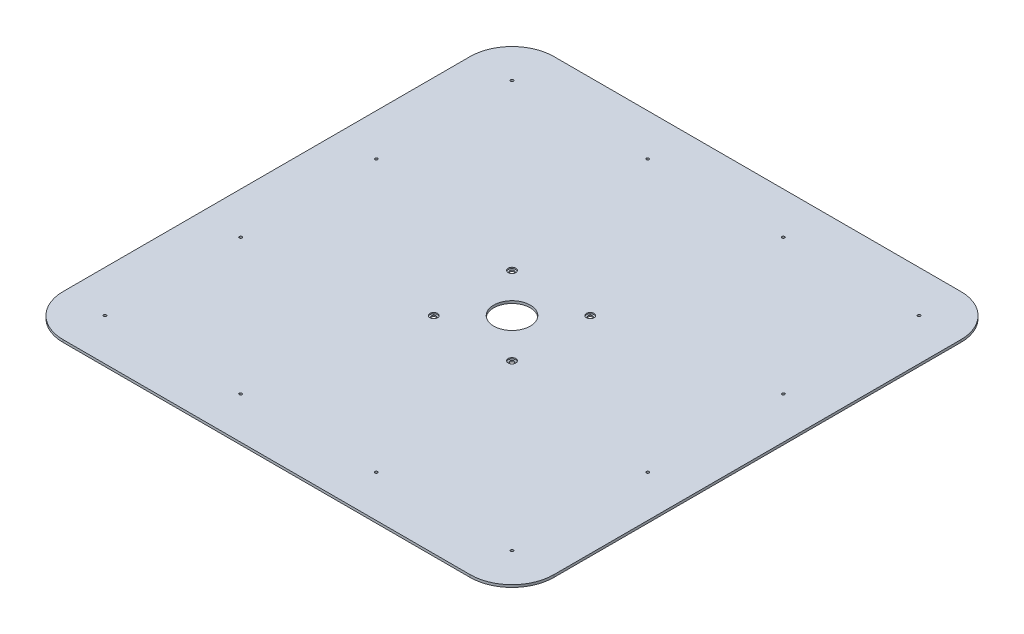
ISO-10303-21;
HEADER;
FILE_DESCRIPTION(('STEP AP214'),'2;1');
FILE_NAME('part.step','',(''),(''),'','','');
FILE_SCHEMA(('AUTOMOTIVE_DESIGN { 1 0 10303 214 1 1 1 1 }'));
ENDSEC;
DATA;
#1=APPLICATION_CONTEXT('core data for automotive mechanical design processes');
#2=APPLICATION_PROTOCOL_DEFINITION('international standard','automotive_design',2000,#1);
#3=PRODUCT_CONTEXT('',#1,'mechanical');
#4=PRODUCT('Part','Part','',(#3));
#5=PRODUCT_RELATED_PRODUCT_CATEGORY('part','',(#4));
#6=PRODUCT_DEFINITION_FORMATION('','',#4);
#7=PRODUCT_DEFINITION_CONTEXT('part definition',#1,'design');
#8=PRODUCT_DEFINITION('design','',#6,#7);
#9=PRODUCT_DEFINITION_SHAPE('','',#8);
#10=(LENGTH_UNIT() NAMED_UNIT(*) SI_UNIT(.MILLI.,.METRE.));
#11=(NAMED_UNIT(*) PLANE_ANGLE_UNIT() SI_UNIT($,.RADIAN.));
#12=(NAMED_UNIT(*) SI_UNIT($,.STERADIAN.) SOLID_ANGLE_UNIT());
#13=UNCERTAINTY_MEASURE_WITH_UNIT(LENGTH_MEASURE(1.E-05),#10,'distance_accuracy_value','');
#14=(GEOMETRIC_REPRESENTATION_CONTEXT(3) GLOBAL_UNCERTAINTY_ASSIGNED_CONTEXT((#13)) GLOBAL_UNIT_ASSIGNED_CONTEXT((#10,
#11,#12)) REPRESENTATION_CONTEXT('',''));
#15=CARTESIAN_POINT('',(0.,0.,0.));
#16=DIRECTION('',(0.,0.,1.));
#17=DIRECTION('',(1.,0.,0.));
#18=AXIS2_PLACEMENT_3D('',#15,#16,#17);
#19=CARTESIAN_POINT('',(-47.625,1.5,47.625));
#20=DIRECTION('',(0.,1.,0.));
#21=DIRECTION('',(0.,0.,1.));
#22=AXIS2_PLACEMENT_3D('',#19,#20,#21);
#23=CYLINDRICAL_SURFACE('',#22,4.699);
#24=CARTESIAN_POINT('',(-47.625,3.,47.625));
#25=DIRECTION('',(0.,1.,0.));
#26=DIRECTION('',(0.,0.,1.));
#27=AXIS2_PLACEMENT_3D('',#24,#25,#26);
#28=CIRCLE('',#27,4.699);
#29=CARTESIAN_POINT('',(-47.625,3.,52.324));
#30=VERTEX_POINT('',#29);
#31=EDGE_CURVE('E244',#30,#30,#28,.F.);
#32=ORIENTED_EDGE('',*,*,#31,.F.);
#33=EDGE_LOOP('',(#32));
#34=FACE_BOUND('',#33,.T.);
#35=CARTESIAN_POINT('',(-47.625,1.5,47.625));
#36=DIRECTION('',(0.,1.,0.));
#37=DIRECTION('',(0.,0.,1.));
#38=AXIS2_PLACEMENT_3D('',#35,#36,#37);
#39=CIRCLE('',#38,4.699);
#40=CARTESIAN_POINT('',(-47.625,1.5,52.324));
#41=VERTEX_POINT('',#40);
#42=EDGE_CURVE('E19',#41,#41,#39,.T.);
#43=ORIENTED_EDGE('',*,*,#42,.F.);
#44=EDGE_LOOP('',(#43));
#45=FACE_BOUND('',#44,.T.);
#46=ADVANCED_FACE('F16',(#34,#45),#23,.F.);
#47=CARTESIAN_POINT('',(47.625,1.5,47.625));
#48=DIRECTION('',(0.,1.,0.));
#49=DIRECTION('',(0.,0.,1.));
#50=AXIS2_PLACEMENT_3D('',#47,#48,#49);
#51=CYLINDRICAL_SURFACE('',#50,4.699);
#52=CARTESIAN_POINT('',(47.625,3.,47.625));
#53=DIRECTION('',(0.,1.,0.));
#54=DIRECTION('',(0.,0.,1.));
#55=AXIS2_PLACEMENT_3D('',#52,#53,#54);
#56=CIRCLE('',#55,4.699);
#57=CARTESIAN_POINT('',(47.625,3.,52.324));
#58=VERTEX_POINT('',#57);
#59=EDGE_CURVE('E241',#58,#58,#56,.F.);
#60=ORIENTED_EDGE('',*,*,#59,.F.);
#61=EDGE_LOOP('',(#60));
#62=FACE_BOUND('',#61,.T.);
#63=CARTESIAN_POINT('',(47.625,1.5,47.625));
#64=DIRECTION('',(0.,1.,0.));
#65=DIRECTION('',(0.,0.,1.));
#66=AXIS2_PLACEMENT_3D('',#63,#64,#65);
#67=CIRCLE('',#66,4.699);
#68=CARTESIAN_POINT('',(47.625,1.5,52.324));
#69=VERTEX_POINT('',#68);
#70=EDGE_CURVE('E252',#69,#69,#67,.T.);
#71=ORIENTED_EDGE('',*,*,#70,.F.);
#72=EDGE_LOOP('',(#71));
#73=FACE_BOUND('',#72,.T.);
#74=ADVANCED_FACE('F262',(#62,#73),#51,.F.);
#75=CARTESIAN_POINT('',(47.625,1.5,-47.625));
#76=DIRECTION('',(0.,1.,0.));
#77=DIRECTION('',(0.,0.,1.));
#78=AXIS2_PLACEMENT_3D('',#75,#76,#77);
#79=CYLINDRICAL_SURFACE('',#78,4.699);
#80=CARTESIAN_POINT('',(47.625,3.,-47.625));
#81=DIRECTION('',(0.,1.,0.));
#82=DIRECTION('',(0.,0.,1.));
#83=AXIS2_PLACEMENT_3D('',#80,#81,#82);
#84=CIRCLE('',#83,4.699);
#85=CARTESIAN_POINT('',(47.625,3.,-42.926));
#86=VERTEX_POINT('',#85);
#87=EDGE_CURVE('E238',#86,#86,#84,.F.);
#88=ORIENTED_EDGE('',*,*,#87,.F.);
#89=EDGE_LOOP('',(#88));
#90=FACE_BOUND('',#89,.T.);
#91=CARTESIAN_POINT('',(47.625,1.5,-47.625));
#92=DIRECTION('',(0.,1.,0.));
#93=DIRECTION('',(0.,0.,1.));
#94=AXIS2_PLACEMENT_3D('',#91,#92,#93);
#95=CIRCLE('',#94,4.699);
#96=CARTESIAN_POINT('',(47.625,1.5,-42.926));
#97=VERTEX_POINT('',#96);
#98=EDGE_CURVE('E250',#97,#97,#95,.T.);
#99=ORIENTED_EDGE('',*,*,#98,.F.);
#100=EDGE_LOOP('',(#99));
#101=FACE_BOUND('',#100,.T.);
#102=ADVANCED_FACE('F268',(#90,#101),#79,.F.);
#103=CARTESIAN_POINT('',(-47.625,1.5,-47.625));
#104=DIRECTION('',(0.,1.,0.));
#105=DIRECTION('',(0.,0.,1.));
#106=AXIS2_PLACEMENT_3D('',#103,#104,#105);
#107=CYLINDRICAL_SURFACE('',#106,4.699);
#108=CARTESIAN_POINT('',(-47.625,3.,-47.625));
#109=DIRECTION('',(0.,1.,0.));
#110=DIRECTION('',(0.,0.,1.));
#111=AXIS2_PLACEMENT_3D('',#108,#109,#110);
#112=CIRCLE('',#111,4.699);
#113=CARTESIAN_POINT('',(-47.625,3.,-42.926));
#114=VERTEX_POINT('',#113);
#115=EDGE_CURVE('E235',#114,#114,#112,.F.);
#116=ORIENTED_EDGE('',*,*,#115,.F.);
#117=EDGE_LOOP('',(#116));
#118=FACE_BOUND('',#117,.T.);
#119=CARTESIAN_POINT('',(-47.625,1.5,-47.625));
#120=DIRECTION('',(0.,1.,0.));
#121=DIRECTION('',(0.,0.,1.));
#122=AXIS2_PLACEMENT_3D('',#119,#120,#121);
#123=CIRCLE('',#122,4.699);
#124=CARTESIAN_POINT('',(-47.625,1.5,-42.926));
#125=VERTEX_POINT('',#124);
#126=EDGE_CURVE('E247',#125,#125,#123,.T.);
#127=ORIENTED_EDGE('',*,*,#126,.F.);
#128=EDGE_LOOP('',(#127));
#129=FACE_BOUND('',#128,.T.);
#130=ADVANCED_FACE('F393',(#118,#129),#107,.F.);
#131=CARTESIAN_POINT('',(-47.625,1.5,47.625));
#132=DIRECTION('',(0.,1.,0.));
#133=DIRECTION('',(0.,0.,1.));
#134=AXIS2_PLACEMENT_3D('',#131,#132,#133);
#135=PLANE('',#134);
#136=CARTESIAN_POINT('',(-47.625,1.5,47.625));
#137=DIRECTION('',(0.,1.,0.));
#138=DIRECTION('',(0.,0.,1.));
#139=AXIS2_PLACEMENT_3D('',#136,#137,#138);
#140=CIRCLE('',#139,2.667);
#141=CARTESIAN_POINT('',(-47.625,1.5,50.292));
#142=VERTEX_POINT('',#141);
#143=EDGE_CURVE('E232',#142,#142,#140,.F.);
#144=ORIENTED_EDGE('',*,*,#143,.T.);
#145=EDGE_LOOP('',(#144));
#146=FACE_BOUND('',#145,.T.);
#147=ORIENTED_EDGE('',*,*,#42,.T.);
#148=EDGE_LOOP('',(#147));
#149=FACE_BOUND('',#148,.T.);
#150=ADVANCED_FACE('F259',(#146,#149),#135,.T.);
#151=CARTESIAN_POINT('',(47.625,1.5,47.625));
#152=DIRECTION('',(0.,1.,0.));
#153=DIRECTION('',(0.,0.,1.));
#154=AXIS2_PLACEMENT_3D('',#151,#152,#153);
#155=PLANE('',#154);
#156=CARTESIAN_POINT('',(47.625,1.5,47.625));
#157=DIRECTION('',(0.,1.,0.));
#158=DIRECTION('',(0.,0.,1.));
#159=AXIS2_PLACEMENT_3D('',#156,#157,#158);
#160=CIRCLE('',#159,2.667);
#161=CARTESIAN_POINT('',(47.625,1.5,50.292));
#162=VERTEX_POINT('',#161);
#163=EDGE_CURVE('E229',#162,#162,#160,.F.);
#164=ORIENTED_EDGE('',*,*,#163,.T.);
#165=EDGE_LOOP('',(#164));
#166=FACE_BOUND('',#165,.T.);
#167=ORIENTED_EDGE('',*,*,#70,.T.);
#168=EDGE_LOOP('',(#167));
#169=FACE_BOUND('',#168,.T.);
#170=ADVANCED_FACE('F386',(#166,#169),#155,.T.);
#171=CARTESIAN_POINT('',(47.625,1.5,-47.625));
#172=DIRECTION('',(0.,1.,0.));
#173=DIRECTION('',(0.,0.,1.));
#174=AXIS2_PLACEMENT_3D('',#171,#172,#173);
#175=PLANE('',#174);
#176=CARTESIAN_POINT('',(47.625,1.5,-47.625));
#177=DIRECTION('',(0.,1.,0.));
#178=DIRECTION('',(0.,0.,1.));
#179=AXIS2_PLACEMENT_3D('',#176,#177,#178);
#180=CIRCLE('',#179,2.667);
#181=CARTESIAN_POINT('',(47.625,1.5,-44.958));
#182=VERTEX_POINT('',#181);
#183=EDGE_CURVE('E226',#182,#182,#180,.F.);
#184=ORIENTED_EDGE('',*,*,#183,.T.);
#185=EDGE_LOOP('',(#184));
#186=FACE_BOUND('',#185,.T.);
#187=ORIENTED_EDGE('',*,*,#98,.T.);
#188=EDGE_LOOP('',(#187));
#189=FACE_BOUND('',#188,.T.);
#190=ADVANCED_FACE('F382',(#186,#189),#175,.T.);
#191=CARTESIAN_POINT('',(-47.625,1.5,-47.625));
#192=DIRECTION('',(0.,1.,0.));
#193=DIRECTION('',(0.,0.,1.));
#194=AXIS2_PLACEMENT_3D('',#191,#192,#193);
#195=PLANE('',#194);
#196=CARTESIAN_POINT('',(-47.625,1.5,-47.625));
#197=DIRECTION('',(0.,1.,0.));
#198=DIRECTION('',(0.,0.,1.));
#199=AXIS2_PLACEMENT_3D('',#196,#197,#198);
#200=CIRCLE('',#199,2.667);
#201=CARTESIAN_POINT('',(-47.625,1.5,-44.958));
#202=VERTEX_POINT('',#201);
#203=EDGE_CURVE('E223',#202,#202,#200,.F.);
#204=ORIENTED_EDGE('',*,*,#203,.T.);
#205=EDGE_LOOP('',(#204));
#206=FACE_BOUND('',#205,.T.);
#207=ORIENTED_EDGE('',*,*,#126,.T.);
#208=EDGE_LOOP('',(#207));
#209=FACE_BOUND('',#208,.T.);
#210=ADVANCED_FACE('F378',(#206,#209),#195,.T.);
#211=CARTESIAN_POINT('',(0.,3.,0.));
#212=DIRECTION('',(0.,1.,0.));
#213=DIRECTION('',(0.,0.,1.));
#214=AXIS2_PLACEMENT_3D('',#211,#212,#213);
#215=PLANE('',#214);
#216=CARTESIAN_POINT('',(0.,3.,1.11022302462516E-13));
#217=DIRECTION('',(0.,-1.,0.));
#218=DIRECTION('',(0.,0.,-1.));
#219=AXIS2_PLACEMENT_3D('',#216,#217,#218);
#220=CIRCLE('',#219,22.225);
#221=CARTESIAN_POINT('',(0.,3.,-22.2249999999999));
#222=VERTEX_POINT('',#221);
#223=EDGE_CURVE('E110',#222,#222,#220,.T.);
#224=ORIENTED_EDGE('',*,*,#223,.T.);
#225=EDGE_LOOP('',(#224));
#226=FACE_BOUND('',#225,.T.);
#227=DIRECTION('',(0.,0.,1.));
#228=VECTOR('',#227,1.);
#229=CARTESIAN_POINT('',(298.45,3.,298.45));
#230=LINE('',#229,#228);
#231=CARTESIAN_POINT('',(298.45,3.,247.65));
#232=VERTEX_POINT('',#231);
#233=CARTESIAN_POINT('',(298.45,3.,-247.65));
#234=VERTEX_POINT('',#233);
#235=EDGE_CURVE('E116',#232,#234,#230,.F.);
#236=ORIENTED_EDGE('',*,*,#235,.T.);
#237=CARTESIAN_POINT('',(247.65,3.,-247.65));
#238=DIRECTION('',(0.,-1.,0.));
#239=DIRECTION('',(0.,0.,-1.));
#240=AXIS2_PLACEMENT_3D('',#237,#238,#239);
#241=CIRCLE('',#240,50.8);
#242=CARTESIAN_POINT('',(247.65,3.,-298.45));
#243=VERTEX_POINT('',#242);
#244=EDGE_CURVE('E117',#243,#234,#241,.T.);
#245=ORIENTED_EDGE('',*,*,#244,.F.);
#246=DIRECTION('',(1.,0.,0.));
#247=VECTOR('',#246,1.);
#248=CARTESIAN_POINT('',(298.45,3.,-298.45));
#249=LINE('',#248,#247);
#250=CARTESIAN_POINT('',(-247.65,3.,-298.45));
#251=VERTEX_POINT('',#250);
#252=EDGE_CURVE('E111',#243,#251,#249,.F.);
#253=ORIENTED_EDGE('',*,*,#252,.T.);
#254=CARTESIAN_POINT('',(-247.65,3.,-247.65));
#255=DIRECTION('',(0.,-1.,0.));
#256=DIRECTION('',(0.,0.,-1.));
#257=AXIS2_PLACEMENT_3D('',#254,#255,#256);
#258=CIRCLE('',#257,50.8);
#259=CARTESIAN_POINT('',(-298.45,3.,-247.65));
#260=VERTEX_POINT('',#259);
#261=EDGE_CURVE('E114',#260,#251,#258,.T.);
#262=ORIENTED_EDGE('',*,*,#261,.F.);
#263=DIRECTION('',(0.,0.,-1.));
#264=VECTOR('',#263,1.);
#265=CARTESIAN_POINT('',(-298.45,3.,298.45));
#266=LINE('',#265,#264);
#267=CARTESIAN_POINT('',(-298.45,3.,247.65));
#268=VERTEX_POINT('',#267);
#269=EDGE_CURVE('E87',#260,#268,#266,.F.);
#270=ORIENTED_EDGE('',*,*,#269,.T.);
#271=CARTESIAN_POINT('',(-247.65,3.,247.65));
#272=DIRECTION('',(0.,-1.,0.));
#273=DIRECTION('',(0.,0.,-1.));
#274=AXIS2_PLACEMENT_3D('',#271,#272,#273);
#275=CIRCLE('',#274,50.8);
#276=CARTESIAN_POINT('',(-247.65,3.,298.45));
#277=VERTEX_POINT('',#276);
#278=EDGE_CURVE('E80',#277,#268,#275,.T.);
#279=ORIENTED_EDGE('',*,*,#278,.F.);
#280=DIRECTION('',(-1.,0.,0.));
#281=VECTOR('',#280,1.);
#282=CARTESIAN_POINT('',(298.45,3.,298.45));
#283=LINE('',#282,#281);
#284=CARTESIAN_POINT('',(247.65,3.,298.45));
#285=VERTEX_POINT('',#284);
#286=EDGE_CURVE('E85',#277,#285,#283,.F.);
#287=ORIENTED_EDGE('',*,*,#286,.T.);
#288=CARTESIAN_POINT('',(247.65,3.,247.65));
#289=DIRECTION('',(0.,-1.,0.));
#290=DIRECTION('',(0.,0.,-1.));
#291=AXIS2_PLACEMENT_3D('',#288,#289,#290);
#292=CIRCLE('',#291,50.8);
#293=EDGE_CURVE('E100',#232,#285,#292,.T.);
#294=ORIENTED_EDGE('',*,*,#293,.F.);
#295=EDGE_LOOP('',(#236,#245,#253,#262,#270,#279,#287,#294));
#296=FACE_BOUND('',#295,.T.);
#297=CARTESIAN_POINT('',(-247.65,3.,-247.65));
#298=DIRECTION('',(0.,1.,0.));
#299=DIRECTION('',(0.,0.,1.));
#300=AXIS2_PLACEMENT_3D('',#297,#298,#299);
#301=CIRCLE('',#300,1.65100000000001);
#302=CARTESIAN_POINT('',(-247.65,3.,-245.999));
#303=VERTEX_POINT('',#302);
#304=EDGE_CURVE('E93',#303,#303,#301,.F.);
#305=ORIENTED_EDGE('',*,*,#304,.T.);
#306=EDGE_LOOP('',(#305));
#307=FACE_BOUND('',#306,.T.);
#308=CARTESIAN_POINT('',(247.65,3.,-247.65));
#309=DIRECTION('',(0.,1.,0.));
#310=DIRECTION('',(0.,0.,1.));
#311=AXIS2_PLACEMENT_3D('',#308,#309,#310);
#312=CIRCLE('',#311,1.65100000000001);
#313=CARTESIAN_POINT('',(247.65,3.,-245.999));
#314=VERTEX_POINT('',#313);
#315=EDGE_CURVE('E190',#314,#314,#312,.F.);
#316=ORIENTED_EDGE('',*,*,#315,.T.);
#317=EDGE_LOOP('',(#316));
#318=FACE_BOUND('',#317,.T.);
#319=CARTESIAN_POINT('',(247.65,3.,247.65));
#320=DIRECTION('',(0.,1.,0.));
#321=DIRECTION('',(0.,0.,1.));
#322=AXIS2_PLACEMENT_3D('',#319,#320,#321);
#323=CIRCLE('',#322,1.65100000000001);
#324=CARTESIAN_POINT('',(247.65,3.,249.301));
#325=VERTEX_POINT('',#324);
#326=EDGE_CURVE('E193',#325,#325,#323,.F.);
#327=ORIENTED_EDGE('',*,*,#326,.T.);
#328=EDGE_LOOP('',(#327));
#329=FACE_BOUND('',#328,.T.);
#330=CARTESIAN_POINT('',(-247.65,3.,247.65));
#331=DIRECTION('',(0.,1.,0.));
#332=DIRECTION('',(0.,0.,1.));
#333=AXIS2_PLACEMENT_3D('',#330,#331,#332);
#334=CIRCLE('',#333,1.65100000000001);
#335=CARTESIAN_POINT('',(-247.65,3.,249.301));
#336=VERTEX_POINT('',#335);
#337=EDGE_CURVE('E196',#336,#336,#334,.F.);
#338=ORIENTED_EDGE('',*,*,#337,.T.);
#339=EDGE_LOOP('',(#338));
#340=FACE_BOUND('',#339,.T.);
#341=CARTESIAN_POINT('',(82.55,3.,-247.65));
#342=DIRECTION('',(0.,1.,0.));
#343=DIRECTION('',(0.,0.,1.));
#344=AXIS2_PLACEMENT_3D('',#341,#342,#343);
#345=CIRCLE('',#344,1.65100000000001);
#346=CARTESIAN_POINT('',(82.55,3.,-245.999));
#347=VERTEX_POINT('',#346);
#348=EDGE_CURVE('E199',#347,#347,#345,.F.);
#349=ORIENTED_EDGE('',*,*,#348,.T.);
#350=EDGE_LOOP('',(#349));
#351=FACE_BOUND('',#350,.T.);
#352=CARTESIAN_POINT('',(-82.55,3.,-247.65));
#353=DIRECTION('',(0.,1.,0.));
#354=DIRECTION('',(0.,0.,1.));
#355=AXIS2_PLACEMENT_3D('',#352,#353,#354);
#356=CIRCLE('',#355,1.65100000000001);
#357=CARTESIAN_POINT('',(-82.55,3.,-245.999));
#358=VERTEX_POINT('',#357);
#359=EDGE_CURVE('E202',#358,#358,#356,.F.);
#360=ORIENTED_EDGE('',*,*,#359,.T.);
#361=EDGE_LOOP('',(#360));
#362=FACE_BOUND('',#361,.T.);
#363=CARTESIAN_POINT('',(247.65,3.,-82.5499999999999));
#364=DIRECTION('',(0.,1.,0.));
#365=DIRECTION('',(0.,0.,1.));
#366=AXIS2_PLACEMENT_3D('',#363,#364,#365);
#367=CIRCLE('',#366,1.65100000000001);
#368=CARTESIAN_POINT('',(247.65,3.,-80.8989999999999));
#369=VERTEX_POINT('',#368);
#370=EDGE_CURVE('E205',#369,#369,#367,.F.);
#371=ORIENTED_EDGE('',*,*,#370,.T.);
#372=EDGE_LOOP('',(#371));
#373=FACE_BOUND('',#372,.T.);
#374=CARTESIAN_POINT('',(247.65,3.,82.5499999999999));
#375=DIRECTION('',(0.,1.,0.));
#376=DIRECTION('',(0.,0.,1.));
#377=AXIS2_PLACEMENT_3D('',#374,#375,#376);
#378=CIRCLE('',#377,1.65100000000001);
#379=CARTESIAN_POINT('',(247.65,3.,84.2009999999999));
#380=VERTEX_POINT('',#379);
#381=EDGE_CURVE('E208',#380,#380,#378,.F.);
#382=ORIENTED_EDGE('',*,*,#381,.T.);
#383=EDGE_LOOP('',(#382));
#384=FACE_BOUND('',#383,.T.);
#385=CARTESIAN_POINT('',(82.55,3.,247.65));
#386=DIRECTION('',(0.,1.,0.));
#387=DIRECTION('',(0.,0.,1.));
#388=AXIS2_PLACEMENT_3D('',#385,#386,#387);
#389=CIRCLE('',#388,1.65100000000001);
#390=CARTESIAN_POINT('',(82.55,3.,249.301));
#391=VERTEX_POINT('',#390);
#392=EDGE_CURVE('E211',#391,#391,#389,.F.);
#393=ORIENTED_EDGE('',*,*,#392,.T.);
#394=EDGE_LOOP('',(#393));
#395=FACE_BOUND('',#394,.T.);
#396=CARTESIAN_POINT('',(-82.55,3.,247.65));
#397=DIRECTION('',(0.,1.,0.));
#398=DIRECTION('',(0.,0.,1.));
#399=AXIS2_PLACEMENT_3D('',#396,#397,#398);
#400=CIRCLE('',#399,1.65100000000001);
#401=CARTESIAN_POINT('',(-82.55,3.,249.301));
#402=VERTEX_POINT('',#401);
#403=EDGE_CURVE('E214',#402,#402,#400,.F.);
#404=ORIENTED_EDGE('',*,*,#403,.T.);
#405=EDGE_LOOP('',(#404));
#406=FACE_BOUND('',#405,.T.);
#407=CARTESIAN_POINT('',(-247.65,3.,82.5499999999999));
#408=DIRECTION('',(0.,1.,0.));
#409=DIRECTION('',(0.,0.,1.));
#410=AXIS2_PLACEMENT_3D('',#407,#408,#409);
#411=CIRCLE('',#410,1.65100000000001);
#412=CARTESIAN_POINT('',(-247.65,3.,84.2009999999999));
#413=VERTEX_POINT('',#412);
#414=EDGE_CURVE('E217',#413,#413,#411,.F.);
#415=ORIENTED_EDGE('',*,*,#414,.T.);
#416=EDGE_LOOP('',(#415));
#417=FACE_BOUND('',#416,.T.);
#418=CARTESIAN_POINT('',(-247.65,3.,-82.5499999999999));
#419=DIRECTION('',(0.,1.,0.));
#420=DIRECTION('',(0.,0.,1.));
#421=AXIS2_PLACEMENT_3D('',#418,#419,#420);
#422=CIRCLE('',#421,1.65100000000001);
#423=CARTESIAN_POINT('',(-247.65,3.,-80.8989999999999));
#424=VERTEX_POINT('',#423);
#425=EDGE_CURVE('E220',#424,#424,#422,.F.);
#426=ORIENTED_EDGE('',*,*,#425,.T.);
#427=EDGE_LOOP('',(#426));
#428=FACE_BOUND('',#427,.T.);
#429=ORIENTED_EDGE('',*,*,#115,.T.);
#430=EDGE_LOOP('',(#429));
#431=FACE_BOUND('',#430,.T.);
#432=ORIENTED_EDGE('',*,*,#87,.T.);
#433=EDGE_LOOP('',(#432));
#434=FACE_BOUND('',#433,.T.);
#435=ORIENTED_EDGE('',*,*,#59,.T.);
#436=EDGE_LOOP('',(#435));
#437=FACE_BOUND('',#436,.T.);
#438=ORIENTED_EDGE('',*,*,#31,.T.);
#439=EDGE_LOOP('',(#438));
#440=FACE_BOUND('',#439,.T.);
#441=ADVANCED_FACE('F83',(#226,#296,#307,#318,#329,#340,#351,#362,#373,#384,#395,#406,#417,#428,
#431,#434,#437,#440),#215,.T.);
#442=CARTESIAN_POINT('',(-47.625,0.,47.625));
#443=DIRECTION('',(0.,1.,0.));
#444=DIRECTION('',(0.,0.,1.));
#445=AXIS2_PLACEMENT_3D('',#442,#443,#444);
#446=CYLINDRICAL_SURFACE('',#445,2.667);
#447=CARTESIAN_POINT('',(-47.625,0.,47.625));
#448=DIRECTION('',(0.,1.,0.));
#449=DIRECTION('',(0.,0.,1.));
#450=AXIS2_PLACEMENT_3D('',#447,#448,#449);
#451=CIRCLE('',#450,2.667);
#452=CARTESIAN_POINT('',(-47.625,0.,50.292));
#453=VERTEX_POINT('',#452);
#454=EDGE_CURVE('E178',#453,#453,#451,.F.);
#455=ORIENTED_EDGE('',*,*,#454,.T.);
#456=EDGE_LOOP('',(#455));
#457=FACE_BOUND('',#456,.T.);
#458=ORIENTED_EDGE('',*,*,#143,.F.);
#459=EDGE_LOOP('',(#458));
#460=FACE_BOUND('',#459,.T.);
#461=ADVANCED_FACE('F371',(#457,#460),#446,.F.);
#462=CARTESIAN_POINT('',(47.625,0.,47.625));
#463=DIRECTION('',(0.,1.,0.));
#464=DIRECTION('',(0.,0.,1.));
#465=AXIS2_PLACEMENT_3D('',#462,#463,#464);
#466=CYLINDRICAL_SURFACE('',#465,2.667);
#467=CARTESIAN_POINT('',(47.625,0.,47.625));
#468=DIRECTION('',(0.,1.,0.));
#469=DIRECTION('',(0.,0.,1.));
#470=AXIS2_PLACEMENT_3D('',#467,#468,#469);
#471=CIRCLE('',#470,2.667);
#472=CARTESIAN_POINT('',(47.625,0.,50.292));
#473=VERTEX_POINT('',#472);
#474=EDGE_CURVE('E175',#473,#473,#471,.F.);
#475=ORIENTED_EDGE('',*,*,#474,.T.);
#476=EDGE_LOOP('',(#475));
#477=FACE_BOUND('',#476,.T.);
#478=ORIENTED_EDGE('',*,*,#163,.F.);
#479=EDGE_LOOP('',(#478));
#480=FACE_BOUND('',#479,.T.);
#481=ADVANCED_FACE('F367',(#477,#480),#466,.F.);
#482=CARTESIAN_POINT('',(47.625,0.,-47.625));
#483=DIRECTION('',(0.,1.,0.));
#484=DIRECTION('',(0.,0.,1.));
#485=AXIS2_PLACEMENT_3D('',#482,#483,#484);
#486=CYLINDRICAL_SURFACE('',#485,2.667);
#487=CARTESIAN_POINT('',(47.625,0.,-47.625));
#488=DIRECTION('',(0.,1.,0.));
#489=DIRECTION('',(0.,0.,1.));
#490=AXIS2_PLACEMENT_3D('',#487,#488,#489);
#491=CIRCLE('',#490,2.667);
#492=CARTESIAN_POINT('',(47.625,0.,-44.958));
#493=VERTEX_POINT('',#492);
#494=EDGE_CURVE('E172',#493,#493,#491,.F.);
#495=ORIENTED_EDGE('',*,*,#494,.T.);
#496=EDGE_LOOP('',(#495));
#497=FACE_BOUND('',#496,.T.);
#498=ORIENTED_EDGE('',*,*,#183,.F.);
#499=EDGE_LOOP('',(#498));
#500=FACE_BOUND('',#499,.T.);
#501=ADVANCED_FACE('F363',(#497,#500),#486,.F.);
#502=CARTESIAN_POINT('',(-47.625,0.,-47.625));
#503=DIRECTION('',(0.,1.,0.));
#504=DIRECTION('',(0.,0.,1.));
#505=AXIS2_PLACEMENT_3D('',#502,#503,#504);
#506=CYLINDRICAL_SURFACE('',#505,2.667);
#507=CARTESIAN_POINT('',(-47.625,0.,-47.625));
#508=DIRECTION('',(0.,1.,0.));
#509=DIRECTION('',(0.,0.,1.));
#510=AXIS2_PLACEMENT_3D('',#507,#508,#509);
#511=CIRCLE('',#510,2.667);
#512=CARTESIAN_POINT('',(-47.625,0.,-44.958));
#513=VERTEX_POINT('',#512);
#514=EDGE_CURVE('E169',#513,#513,#511,.F.);
#515=ORIENTED_EDGE('',*,*,#514,.T.);
#516=EDGE_LOOP('',(#515));
#517=FACE_BOUND('',#516,.T.);
#518=ORIENTED_EDGE('',*,*,#203,.F.);
#519=EDGE_LOOP('',(#518));
#520=FACE_BOUND('',#519,.T.);
#521=ADVANCED_FACE('F359',(#517,#520),#506,.F.);
#522=CARTESIAN_POINT('',(-247.65,0.,-82.5499999999999));
#523=DIRECTION('',(0.,1.,0.));
#524=DIRECTION('',(0.,0.,1.));
#525=AXIS2_PLACEMENT_3D('',#522,#523,#524);
#526=CYLINDRICAL_SURFACE('',#525,1.65100000000001);
#527=CARTESIAN_POINT('',(-247.65,0.,-82.5499999999999));
#528=DIRECTION('',(0.,1.,0.));
#529=DIRECTION('',(0.,0.,1.));
#530=AXIS2_PLACEMENT_3D('',#527,#528,#529);
#531=CIRCLE('',#530,1.65100000000001);
#532=CARTESIAN_POINT('',(-247.65,0.,-80.8989999999999));
#533=VERTEX_POINT('',#532);
#534=EDGE_CURVE('E166',#533,#533,#531,.F.);
#535=ORIENTED_EDGE('',*,*,#534,.T.);
#536=EDGE_LOOP('',(#535));
#537=FACE_BOUND('',#536,.T.);
#538=ORIENTED_EDGE('',*,*,#425,.F.);
#539=EDGE_LOOP('',(#538));
#540=FACE_BOUND('',#539,.T.);
#541=ADVANCED_FACE('F355',(#537,#540),#526,.F.);
#542=CARTESIAN_POINT('',(-247.65,0.,82.5499999999999));
#543=DIRECTION('',(0.,1.,0.));
#544=DIRECTION('',(0.,0.,1.));
#545=AXIS2_PLACEMENT_3D('',#542,#543,#544);
#546=CYLINDRICAL_SURFACE('',#545,1.65100000000001);
#547=CARTESIAN_POINT('',(-247.65,0.,82.5499999999999));
#548=DIRECTION('',(0.,1.,0.));
#549=DIRECTION('',(0.,0.,1.));
#550=AXIS2_PLACEMENT_3D('',#547,#548,#549);
#551=CIRCLE('',#550,1.65100000000001);
#552=CARTESIAN_POINT('',(-247.65,0.,84.2009999999999));
#553=VERTEX_POINT('',#552);
#554=EDGE_CURVE('E163',#553,#553,#551,.F.);
#555=ORIENTED_EDGE('',*,*,#554,.T.);
#556=EDGE_LOOP('',(#555));
#557=FACE_BOUND('',#556,.T.);
#558=ORIENTED_EDGE('',*,*,#414,.F.);
#559=EDGE_LOOP('',(#558));
#560=FACE_BOUND('',#559,.T.);
#561=ADVANCED_FACE('F351',(#557,#560),#546,.F.);
#562=CARTESIAN_POINT('',(-82.55,0.,247.65));
#563=DIRECTION('',(0.,1.,0.));
#564=DIRECTION('',(0.,0.,1.));
#565=AXIS2_PLACEMENT_3D('',#562,#563,#564);
#566=CYLINDRICAL_SURFACE('',#565,1.65100000000001);
#567=CARTESIAN_POINT('',(-82.55,0.,247.65));
#568=DIRECTION('',(0.,1.,0.));
#569=DIRECTION('',(0.,0.,1.));
#570=AXIS2_PLACEMENT_3D('',#567,#568,#569);
#571=CIRCLE('',#570,1.65100000000001);
#572=CARTESIAN_POINT('',(-82.55,0.,249.301));
#573=VERTEX_POINT('',#572);
#574=EDGE_CURVE('E160',#573,#573,#571,.F.);
#575=ORIENTED_EDGE('',*,*,#574,.T.);
#576=EDGE_LOOP('',(#575));
#577=FACE_BOUND('',#576,.T.);
#578=ORIENTED_EDGE('',*,*,#403,.F.);
#579=EDGE_LOOP('',(#578));
#580=FACE_BOUND('',#579,.T.);
#581=ADVANCED_FACE('F347',(#577,#580),#566,.F.);
#582=CARTESIAN_POINT('',(82.55,0.,247.65));
#583=DIRECTION('',(0.,1.,0.));
#584=DIRECTION('',(0.,0.,1.));
#585=AXIS2_PLACEMENT_3D('',#582,#583,#584);
#586=CYLINDRICAL_SURFACE('',#585,1.65100000000001);
#587=CARTESIAN_POINT('',(82.55,0.,247.65));
#588=DIRECTION('',(0.,1.,0.));
#589=DIRECTION('',(0.,0.,1.));
#590=AXIS2_PLACEMENT_3D('',#587,#588,#589);
#591=CIRCLE('',#590,1.65100000000001);
#592=CARTESIAN_POINT('',(82.55,0.,249.301));
#593=VERTEX_POINT('',#592);
#594=EDGE_CURVE('E157',#593,#593,#591,.F.);
#595=ORIENTED_EDGE('',*,*,#594,.T.);
#596=EDGE_LOOP('',(#595));
#597=FACE_BOUND('',#596,.T.);
#598=ORIENTED_EDGE('',*,*,#392,.F.);
#599=EDGE_LOOP('',(#598));
#600=FACE_BOUND('',#599,.T.);
#601=ADVANCED_FACE('F343',(#597,#600),#586,.F.);
#602=CARTESIAN_POINT('',(247.65,0.,82.5499999999999));
#603=DIRECTION('',(0.,1.,0.));
#604=DIRECTION('',(0.,0.,1.));
#605=AXIS2_PLACEMENT_3D('',#602,#603,#604);
#606=CYLINDRICAL_SURFACE('',#605,1.65100000000001);
#607=CARTESIAN_POINT('',(247.65,0.,82.5499999999999));
#608=DIRECTION('',(0.,1.,0.));
#609=DIRECTION('',(0.,0.,1.));
#610=AXIS2_PLACEMENT_3D('',#607,#608,#609);
#611=CIRCLE('',#610,1.65100000000001);
#612=CARTESIAN_POINT('',(247.65,0.,84.2009999999999));
#613=VERTEX_POINT('',#612);
#614=EDGE_CURVE('E154',#613,#613,#611,.F.);
#615=ORIENTED_EDGE('',*,*,#614,.T.);
#616=EDGE_LOOP('',(#615));
#617=FACE_BOUND('',#616,.T.);
#618=ORIENTED_EDGE('',*,*,#381,.F.);
#619=EDGE_LOOP('',(#618));
#620=FACE_BOUND('',#619,.T.);
#621=ADVANCED_FACE('F339',(#617,#620),#606,.F.);
#622=CARTESIAN_POINT('',(247.65,0.,-82.5499999999999));
#623=DIRECTION('',(0.,1.,0.));
#624=DIRECTION('',(0.,0.,1.));
#625=AXIS2_PLACEMENT_3D('',#622,#623,#624);
#626=CYLINDRICAL_SURFACE('',#625,1.65100000000001);
#627=CARTESIAN_POINT('',(247.65,0.,-82.5499999999999));
#628=DIRECTION('',(0.,1.,0.));
#629=DIRECTION('',(0.,0.,1.));
#630=AXIS2_PLACEMENT_3D('',#627,#628,#629);
#631=CIRCLE('',#630,1.65100000000001);
#632=CARTESIAN_POINT('',(247.65,0.,-80.8989999999999));
#633=VERTEX_POINT('',#632);
#634=EDGE_CURVE('E151',#633,#633,#631,.F.);
#635=ORIENTED_EDGE('',*,*,#634,.T.);
#636=EDGE_LOOP('',(#635));
#637=FACE_BOUND('',#636,.T.);
#638=ORIENTED_EDGE('',*,*,#370,.F.);
#639=EDGE_LOOP('',(#638));
#640=FACE_BOUND('',#639,.T.);
#641=ADVANCED_FACE('F335',(#637,#640),#626,.F.);
#642=CARTESIAN_POINT('',(-82.55,0.,-247.65));
#643=DIRECTION('',(0.,1.,0.));
#644=DIRECTION('',(0.,0.,1.));
#645=AXIS2_PLACEMENT_3D('',#642,#643,#644);
#646=CYLINDRICAL_SURFACE('',#645,1.65100000000001);
#647=CARTESIAN_POINT('',(-82.55,0.,-247.65));
#648=DIRECTION('',(0.,1.,0.));
#649=DIRECTION('',(0.,0.,1.));
#650=AXIS2_PLACEMENT_3D('',#647,#648,#649);
#651=CIRCLE('',#650,1.65100000000001);
#652=CARTESIAN_POINT('',(-82.55,0.,-245.999));
#653=VERTEX_POINT('',#652);
#654=EDGE_CURVE('E148',#653,#653,#651,.F.);
#655=ORIENTED_EDGE('',*,*,#654,.T.);
#656=EDGE_LOOP('',(#655));
#657=FACE_BOUND('',#656,.T.);
#658=ORIENTED_EDGE('',*,*,#359,.F.);
#659=EDGE_LOOP('',(#658));
#660=FACE_BOUND('',#659,.T.);
#661=ADVANCED_FACE('F331',(#657,#660),#646,.F.);
#662=CARTESIAN_POINT('',(82.55,0.,-247.65));
#663=DIRECTION('',(0.,1.,0.));
#664=DIRECTION('',(0.,0.,1.));
#665=AXIS2_PLACEMENT_3D('',#662,#663,#664);
#666=CYLINDRICAL_SURFACE('',#665,1.65100000000001);
#667=CARTESIAN_POINT('',(82.55,0.,-247.65));
#668=DIRECTION('',(0.,1.,0.));
#669=DIRECTION('',(0.,0.,1.));
#670=AXIS2_PLACEMENT_3D('',#667,#668,#669);
#671=CIRCLE('',#670,1.65100000000001);
#672=CARTESIAN_POINT('',(82.55,0.,-245.999));
#673=VERTEX_POINT('',#672);
#674=EDGE_CURVE('E145',#673,#673,#671,.F.);
#675=ORIENTED_EDGE('',*,*,#674,.T.);
#676=EDGE_LOOP('',(#675));
#677=FACE_BOUND('',#676,.T.);
#678=ORIENTED_EDGE('',*,*,#348,.F.);
#679=EDGE_LOOP('',(#678));
#680=FACE_BOUND('',#679,.T.);
#681=ADVANCED_FACE('F327',(#677,#680),#666,.F.);
#682=CARTESIAN_POINT('',(-247.65,0.,247.65));
#683=DIRECTION('',(0.,1.,0.));
#684=DIRECTION('',(0.,0.,1.));
#685=AXIS2_PLACEMENT_3D('',#682,#683,#684);
#686=CYLINDRICAL_SURFACE('',#685,1.65100000000001);
#687=CARTESIAN_POINT('',(-247.65,0.,247.65));
#688=DIRECTION('',(0.,1.,0.));
#689=DIRECTION('',(0.,0.,1.));
#690=AXIS2_PLACEMENT_3D('',#687,#688,#689);
#691=CIRCLE('',#690,1.65100000000001);
#692=CARTESIAN_POINT('',(-247.65,0.,249.301));
#693=VERTEX_POINT('',#692);
#694=EDGE_CURVE('E142',#693,#693,#691,.F.);
#695=ORIENTED_EDGE('',*,*,#694,.T.);
#696=EDGE_LOOP('',(#695));
#697=FACE_BOUND('',#696,.T.);
#698=ORIENTED_EDGE('',*,*,#337,.F.);
#699=EDGE_LOOP('',(#698));
#700=FACE_BOUND('',#699,.T.);
#701=ADVANCED_FACE('F323',(#697,#700),#686,.F.);
#702=CARTESIAN_POINT('',(247.65,0.,247.65));
#703=DIRECTION('',(0.,1.,0.));
#704=DIRECTION('',(0.,0.,1.));
#705=AXIS2_PLACEMENT_3D('',#702,#703,#704);
#706=CYLINDRICAL_SURFACE('',#705,1.65100000000001);
#707=CARTESIAN_POINT('',(247.65,0.,247.65));
#708=DIRECTION('',(0.,1.,0.));
#709=DIRECTION('',(0.,0.,1.));
#710=AXIS2_PLACEMENT_3D('',#707,#708,#709);
#711=CIRCLE('',#710,1.65100000000001);
#712=CARTESIAN_POINT('',(247.65,0.,249.301));
#713=VERTEX_POINT('',#712);
#714=EDGE_CURVE('E139',#713,#713,#711,.F.);
#715=ORIENTED_EDGE('',*,*,#714,.T.);
#716=EDGE_LOOP('',(#715));
#717=FACE_BOUND('',#716,.T.);
#718=ORIENTED_EDGE('',*,*,#326,.F.);
#719=EDGE_LOOP('',(#718));
#720=FACE_BOUND('',#719,.T.);
#721=ADVANCED_FACE('F319',(#717,#720),#706,.F.);
#722=CARTESIAN_POINT('',(247.65,0.,-247.65));
#723=DIRECTION('',(0.,1.,0.));
#724=DIRECTION('',(0.,0.,1.));
#725=AXIS2_PLACEMENT_3D('',#722,#723,#724);
#726=CYLINDRICAL_SURFACE('',#725,1.65100000000001);
#727=CARTESIAN_POINT('',(247.65,0.,-247.65));
#728=DIRECTION('',(0.,1.,0.));
#729=DIRECTION('',(0.,0.,1.));
#730=AXIS2_PLACEMENT_3D('',#727,#728,#729);
#731=CIRCLE('',#730,1.65100000000001);
#732=CARTESIAN_POINT('',(247.65,0.,-245.999));
#733=VERTEX_POINT('',#732);
#734=EDGE_CURVE('E136',#733,#733,#731,.F.);
#735=ORIENTED_EDGE('',*,*,#734,.T.);
#736=EDGE_LOOP('',(#735));
#737=FACE_BOUND('',#736,.T.);
#738=ORIENTED_EDGE('',*,*,#315,.F.);
#739=EDGE_LOOP('',(#738));
#740=FACE_BOUND('',#739,.T.);
#741=ADVANCED_FACE('F315',(#737,#740),#726,.F.);
#742=CARTESIAN_POINT('',(-247.65,0.,-247.65));
#743=DIRECTION('',(0.,1.,0.));
#744=DIRECTION('',(0.,0.,1.));
#745=AXIS2_PLACEMENT_3D('',#742,#743,#744);
#746=CYLINDRICAL_SURFACE('',#745,1.65100000000001);
#747=CARTESIAN_POINT('',(-247.65,0.,-247.65));
#748=DIRECTION('',(0.,1.,0.));
#749=DIRECTION('',(0.,0.,1.));
#750=AXIS2_PLACEMENT_3D('',#747,#748,#749);
#751=CIRCLE('',#750,1.65100000000001);
#752=CARTESIAN_POINT('',(-247.65,0.,-245.999));
#753=VERTEX_POINT('',#752);
#754=EDGE_CURVE('E133',#753,#753,#751,.F.);
#755=ORIENTED_EDGE('',*,*,#754,.T.);
#756=EDGE_LOOP('',(#755));
#757=FACE_BOUND('',#756,.T.);
#758=ORIENTED_EDGE('',*,*,#304,.F.);
#759=EDGE_LOOP('',(#758));
#760=FACE_BOUND('',#759,.T.);
#761=ADVANCED_FACE('F312',(#757,#760),#746,.F.);
#762=CARTESIAN_POINT('',(-247.65,3.,247.65));
#763=DIRECTION('',(0.,-1.,0.));
#764=DIRECTION('',(0.,0.,-1.));
#765=AXIS2_PLACEMENT_3D('',#762,#763,#764);
#766=CYLINDRICAL_SURFACE('',#765,50.8);
#767=CARTESIAN_POINT('',(-247.65,0.,247.65));
#768=DIRECTION('',(0.,-1.,0.));
#769=DIRECTION('',(0.,0.,-1.));
#770=AXIS2_PLACEMENT_3D('',#767,#768,#769);
#771=CIRCLE('',#770,50.8);
#772=CARTESIAN_POINT('',(-298.45,0.,247.65));
#773=VERTEX_POINT('',#772);
#774=CARTESIAN_POINT('',(-247.65,0.,298.45));
#775=VERTEX_POINT('',#774);
#776=EDGE_CURVE('E104',#773,#775,#771,.F.);
#777=ORIENTED_EDGE('',*,*,#776,.T.);
#778=DIRECTION('',(0.,1.,0.));
#779=VECTOR('',#778,1.);
#780=CARTESIAN_POINT('',(-247.65,3.,298.45));
#781=LINE('',#780,#779);
#782=EDGE_CURVE('E92',#775,#277,#781,.T.);
#783=ORIENTED_EDGE('',*,*,#782,.T.);
#784=ORIENTED_EDGE('',*,*,#278,.T.);
#785=DIRECTION('',(0.,1.,0.));
#786=VECTOR('',#785,1.);
#787=CARTESIAN_POINT('',(-298.45,3.,247.65));
#788=LINE('',#787,#786);
#789=EDGE_CURVE('E749',#268,#773,#788,.F.);
#790=ORIENTED_EDGE('',*,*,#789,.T.);
#791=EDGE_LOOP('',(#777,#783,#784,#790));
#792=FACE_BOUND('',#791,.T.);
#793=ADVANCED_FACE('F103',(#792),#766,.T.);
#794=CARTESIAN_POINT('',(298.45,3.,298.45));
#795=DIRECTION('',(0.,0.,-1.));
#796=DIRECTION('',(-1.,0.,0.));
#797=AXIS2_PLACEMENT_3D('',#794,#795,#796);
#798=PLANE('',#797);
#799=ORIENTED_EDGE('',*,*,#782,.F.);
#800=DIRECTION('',(1.,0.,0.));
#801=VECTOR('',#800,1.);
#802=CARTESIAN_POINT('',(0.,0.,298.45));
#803=LINE('',#802,#801);
#804=CARTESIAN_POINT('',(247.65,0.,298.45));
#805=VERTEX_POINT('',#804);
#806=EDGE_CURVE('E131',#775,#805,#803,.T.);
#807=ORIENTED_EDGE('',*,*,#806,.T.);
#808=DIRECTION('',(0.,-1.,0.));
#809=VECTOR('',#808,1.);
#810=CARTESIAN_POINT('',(247.65,3.,298.45));
#811=LINE('',#810,#809);
#812=EDGE_CURVE('E99',#285,#805,#811,.T.);
#813=ORIENTED_EDGE('',*,*,#812,.F.);
#814=ORIENTED_EDGE('',*,*,#286,.F.);
#815=EDGE_LOOP('',(#799,#807,#813,#814));
#816=FACE_BOUND('',#815,.T.);
#817=ADVANCED_FACE('F96',(#816),#798,.F.);
#818=CARTESIAN_POINT('',(247.65,3.,247.65));
#819=DIRECTION('',(0.,-1.,0.));
#820=DIRECTION('',(0.,0.,-1.));
#821=AXIS2_PLACEMENT_3D('',#818,#819,#820);
#822=CYLINDRICAL_SURFACE('',#821,50.8);
#823=CARTESIAN_POINT('',(247.65,0.,247.65));
#824=DIRECTION('',(0.,-1.,0.));
#825=DIRECTION('',(0.,0.,-1.));
#826=AXIS2_PLACEMENT_3D('',#823,#824,#825);
#827=CIRCLE('',#826,50.8);
#828=CARTESIAN_POINT('',(298.45,0.,247.65));
#829=VERTEX_POINT('',#828);
#830=EDGE_CURVE('E128',#805,#829,#827,.F.);
#831=ORIENTED_EDGE('',*,*,#830,.T.);
#832=DIRECTION('',(0.,1.,0.));
#833=VECTOR('',#832,1.);
#834=CARTESIAN_POINT('',(298.45,3.,247.65));
#835=LINE('',#834,#833);
#836=EDGE_CURVE('E118',#829,#232,#835,.T.);
#837=ORIENTED_EDGE('',*,*,#836,.T.);
#838=ORIENTED_EDGE('',*,*,#293,.T.);
#839=ORIENTED_EDGE('',*,*,#812,.T.);
#840=EDGE_LOOP('',(#831,#837,#838,#839));
#841=FACE_BOUND('',#840,.T.);
#842=ADVANCED_FACE('F303',(#841),#822,.T.);
#843=CARTESIAN_POINT('',(298.45,3.,298.45));
#844=DIRECTION('',(-1.,0.,0.));
#845=DIRECTION('',(0.,0.,1.));
#846=AXIS2_PLACEMENT_3D('',#843,#844,#845);
#847=PLANE('',#846);
#848=DIRECTION('',(0.,-1.,0.));
#849=VECTOR('',#848,1.);
#850=CARTESIAN_POINT('',(298.45,3.,-247.65));
#851=LINE('',#850,#849);
#852=CARTESIAN_POINT('',(298.45,0.,-247.65));
#853=VERTEX_POINT('',#852);
#854=EDGE_CURVE('E186',#234,#853,#851,.T.);
#855=ORIENTED_EDGE('',*,*,#854,.F.);
#856=ORIENTED_EDGE('',*,*,#235,.F.);
#857=ORIENTED_EDGE('',*,*,#836,.F.);
#858=DIRECTION('',(0.,0.,1.));
#859=VECTOR('',#858,1.);
#860=CARTESIAN_POINT('',(298.45,0.,0.));
#861=LINE('',#860,#859);
#862=EDGE_CURVE('E127',#829,#853,#861,.F.);
#863=ORIENTED_EDGE('',*,*,#862,.T.);
#864=EDGE_LOOP('',(#855,#856,#857,#863));
#865=FACE_BOUND('',#864,.T.);
#866=ADVANCED_FACE('F299',(#865),#847,.F.);
#867=CARTESIAN_POINT('',(247.65,3.,-247.65));
#868=DIRECTION('',(0.,-1.,0.));
#869=DIRECTION('',(0.,0.,-1.));
#870=AXIS2_PLACEMENT_3D('',#867,#868,#869);
#871=CYLINDRICAL_SURFACE('',#870,50.8);
#872=CARTESIAN_POINT('',(247.65,0.,-247.65));
#873=DIRECTION('',(0.,-1.,0.));
#874=DIRECTION('',(0.,0.,-1.));
#875=AXIS2_PLACEMENT_3D('',#872,#873,#874);
#876=CIRCLE('',#875,50.8);
#877=CARTESIAN_POINT('',(247.65,0.,-298.45));
#878=VERTEX_POINT('',#877);
#879=EDGE_CURVE('E124',#853,#878,#876,.F.);
#880=ORIENTED_EDGE('',*,*,#879,.T.);
#881=DIRECTION('',(0.,1.,0.));
#882=VECTOR('',#881,1.);
#883=CARTESIAN_POINT('',(247.65,3.,-298.45));
#884=LINE('',#883,#882);
#885=EDGE_CURVE('E115',#878,#243,#884,.T.);
#886=ORIENTED_EDGE('',*,*,#885,.T.);
#887=ORIENTED_EDGE('',*,*,#244,.T.);
#888=ORIENTED_EDGE('',*,*,#854,.T.);
#889=EDGE_LOOP('',(#880,#886,#887,#888));
#890=FACE_BOUND('',#889,.T.);
#891=ADVANCED_FACE('F295',(#890),#871,.T.);
#892=CARTESIAN_POINT('',(298.45,3.,-298.45));
#893=DIRECTION('',(0.,0.,1.));
#894=DIRECTION('',(1.,0.,0.));
#895=AXIS2_PLACEMENT_3D('',#892,#893,#894);
#896=PLANE('',#895);
#897=DIRECTION('',(0.,-1.,0.));
#898=VECTOR('',#897,1.);
#899=CARTESIAN_POINT('',(-247.65,3.,-298.45));
#900=LINE('',#899,#898);
#901=CARTESIAN_POINT('',(-247.65,0.,-298.45));
#902=VERTEX_POINT('',#901);
#903=EDGE_CURVE('E184',#251,#902,#900,.T.);
#904=ORIENTED_EDGE('',*,*,#903,.F.);
#905=ORIENTED_EDGE('',*,*,#252,.F.);
#906=ORIENTED_EDGE('',*,*,#885,.F.);
#907=DIRECTION('',(1.,0.,0.));
#908=VECTOR('',#907,1.);
#909=CARTESIAN_POINT('',(0.,0.,-298.45));
#910=LINE('',#909,#908);
#911=EDGE_CURVE('E123',#878,#902,#910,.F.);
#912=ORIENTED_EDGE('',*,*,#911,.T.);
#913=EDGE_LOOP('',(#904,#905,#906,#912));
#914=FACE_BOUND('',#913,.T.);
#915=ADVANCED_FACE('F291',(#914),#896,.F.);
#916=CARTESIAN_POINT('',(-247.65,3.,-247.65));
#917=DIRECTION('',(0.,-1.,0.));
#918=DIRECTION('',(0.,0.,-1.));
#919=AXIS2_PLACEMENT_3D('',#916,#917,#918);
#920=CYLINDRICAL_SURFACE('',#919,50.8);
#921=CARTESIAN_POINT('',(-247.65,0.,-247.65));
#922=DIRECTION('',(0.,-1.,0.));
#923=DIRECTION('',(0.,0.,-1.));
#924=AXIS2_PLACEMENT_3D('',#921,#922,#923);
#925=CIRCLE('',#924,50.8);
#926=CARTESIAN_POINT('',(-298.45,0.,-247.65));
#927=VERTEX_POINT('',#926);
#928=EDGE_CURVE('E120',#902,#927,#925,.F.);
#929=ORIENTED_EDGE('',*,*,#928,.T.);
#930=DIRECTION('',(0.,1.,0.));
#931=VECTOR('',#930,1.);
#932=CARTESIAN_POINT('',(-298.45,3.,-247.65));
#933=LINE('',#932,#931);
#934=EDGE_CURVE('E34',#927,#260,#933,.T.);
#935=ORIENTED_EDGE('',*,*,#934,.T.);
#936=ORIENTED_EDGE('',*,*,#261,.T.);
#937=ORIENTED_EDGE('',*,*,#903,.T.);
#938=EDGE_LOOP('',(#929,#935,#936,#937));
#939=FACE_BOUND('',#938,.T.);
#940=ADVANCED_FACE('F288',(#939),#920,.T.);
#941=CARTESIAN_POINT('',(-298.45,3.,298.45));
#942=DIRECTION('',(1.,0.,0.));
#943=DIRECTION('',(0.,0.,-1.));
#944=AXIS2_PLACEMENT_3D('',#941,#942,#943);
#945=PLANE('',#944);
#946=ORIENTED_EDGE('',*,*,#934,.F.);
#947=DIRECTION('',(0.,0.,1.));
#948=VECTOR('',#947,1.);
#949=CARTESIAN_POINT('',(-298.45,0.,0.));
#950=LINE('',#949,#948);
#951=EDGE_CURVE('E25',#927,#773,#950,.T.);
#952=ORIENTED_EDGE('',*,*,#951,.T.);
#953=ORIENTED_EDGE('',*,*,#789,.F.);
#954=ORIENTED_EDGE('',*,*,#269,.F.);
#955=EDGE_LOOP('',(#946,#952,#953,#954));
#956=FACE_BOUND('',#955,.T.);
#957=ADVANCED_FACE('F280',(#956),#945,.F.);
#958=CARTESIAN_POINT('',(0.,3.,1.11022302462516E-13));
#959=DIRECTION('',(0.,-1.,0.));
#960=DIRECTION('',(0.,0.,-1.));
#961=AXIS2_PLACEMENT_3D('',#958,#959,#960);
#962=CYLINDRICAL_SURFACE('',#961,22.225);
#963=CARTESIAN_POINT('',(0.,0.,1.11022302462516E-13));
#964=DIRECTION('',(0.,-1.,0.));
#965=DIRECTION('',(0.,0.,-1.));
#966=AXIS2_PLACEMENT_3D('',#963,#964,#965);
#967=CIRCLE('',#966,22.225);
#968=CARTESIAN_POINT('',(0.,0.,-22.2249999999999));
#969=VERTEX_POINT('',#968);
#970=EDGE_CURVE('E11',#969,#969,#967,.T.);
#971=ORIENTED_EDGE('',*,*,#970,.T.);
#972=EDGE_LOOP('',(#971));
#973=FACE_BOUND('',#972,.T.);
#974=ORIENTED_EDGE('',*,*,#223,.F.);
#975=EDGE_LOOP('',(#974));
#976=FACE_BOUND('',#975,.T.);
#977=ADVANCED_FACE('F273',(#973,#976),#962,.F.);
#978=CARTESIAN_POINT('',(0.,0.,0.));
#979=DIRECTION('',(0.,1.,0.));
#980=DIRECTION('',(0.,0.,1.));
#981=AXIS2_PLACEMENT_3D('',#978,#979,#980);
#982=PLANE('',#981);
#983=ORIENTED_EDGE('',*,*,#970,.F.);
#984=EDGE_LOOP('',(#983));
#985=FACE_BOUND('',#984,.T.);
#986=ORIENTED_EDGE('',*,*,#928,.F.);
#987=ORIENTED_EDGE('',*,*,#911,.F.);
#988=ORIENTED_EDGE('',*,*,#879,.F.);
#989=ORIENTED_EDGE('',*,*,#862,.F.);
#990=ORIENTED_EDGE('',*,*,#830,.F.);
#991=ORIENTED_EDGE('',*,*,#806,.F.);
#992=ORIENTED_EDGE('',*,*,#776,.F.);
#993=ORIENTED_EDGE('',*,*,#951,.F.);
#994=EDGE_LOOP('',(#986,#987,#988,#989,#990,#991,#992,#993));
#995=FACE_BOUND('',#994,.T.);
#996=ORIENTED_EDGE('',*,*,#754,.F.);
#997=EDGE_LOOP('',(#996));
#998=FACE_BOUND('',#997,.T.);
#999=ORIENTED_EDGE('',*,*,#734,.F.);
#1000=EDGE_LOOP('',(#999));
#1001=FACE_BOUND('',#1000,.T.);
#1002=ORIENTED_EDGE('',*,*,#714,.F.);
#1003=EDGE_LOOP('',(#1002));
#1004=FACE_BOUND('',#1003,.T.);
#1005=ORIENTED_EDGE('',*,*,#694,.F.);
#1006=EDGE_LOOP('',(#1005));
#1007=FACE_BOUND('',#1006,.T.);
#1008=ORIENTED_EDGE('',*,*,#674,.F.);
#1009=EDGE_LOOP('',(#1008));
#1010=FACE_BOUND('',#1009,.T.);
#1011=ORIENTED_EDGE('',*,*,#654,.F.);
#1012=EDGE_LOOP('',(#1011));
#1013=FACE_BOUND('',#1012,.T.);
#1014=ORIENTED_EDGE('',*,*,#634,.F.);
#1015=EDGE_LOOP('',(#1014));
#1016=FACE_BOUND('',#1015,.T.);
#1017=ORIENTED_EDGE('',*,*,#614,.F.);
#1018=EDGE_LOOP('',(#1017));
#1019=FACE_BOUND('',#1018,.T.);
#1020=ORIENTED_EDGE('',*,*,#594,.F.);
#1021=EDGE_LOOP('',(#1020));
#1022=FACE_BOUND('',#1021,.T.);
#1023=ORIENTED_EDGE('',*,*,#574,.F.);
#1024=EDGE_LOOP('',(#1023));
#1025=FACE_BOUND('',#1024,.T.);
#1026=ORIENTED_EDGE('',*,*,#554,.F.);
#1027=EDGE_LOOP('',(#1026));
#1028=FACE_BOUND('',#1027,.T.);
#1029=ORIENTED_EDGE('',*,*,#534,.F.);
#1030=EDGE_LOOP('',(#1029));
#1031=FACE_BOUND('',#1030,.T.);
#1032=ORIENTED_EDGE('',*,*,#514,.F.);
#1033=EDGE_LOOP('',(#1032));
#1034=FACE_BOUND('',#1033,.T.);
#1035=ORIENTED_EDGE('',*,*,#494,.F.);
#1036=EDGE_LOOP('',(#1035));
#1037=FACE_BOUND('',#1036,.T.);
#1038=ORIENTED_EDGE('',*,*,#474,.F.);
#1039=EDGE_LOOP('',(#1038));
#1040=FACE_BOUND('',#1039,.T.);
#1041=ORIENTED_EDGE('',*,*,#454,.F.);
#1042=EDGE_LOOP('',(#1041));
#1043=FACE_BOUND('',#1042,.T.);
#1044=ADVANCED_FACE('F271',(#985,#995,#998,#1001,#1004,#1007,#1010,#1013,#1016,#1019,#1022,
#1025,#1028,#1031,#1034,#1037,#1040,#1043),#982,.F.);
#1045=CLOSED_SHELL('',(#46,#74,#102,#130,#150,#170,#190,#210,#441,#461,#481,#501,#521,#541,#561,
#581,#601,#621,#641,#661,#681,#701,#721,#741,#761,#793,#817,#842,#866,#891,#915,#940,#957,#977,#1044));
#1046=MANIFOLD_SOLID_BREP('B1',#1045);
#1047=ADVANCED_BREP_SHAPE_REPRESENTATION('',(#18,#1046),#14);
#1048=SHAPE_DEFINITION_REPRESENTATION(#9,#1047);
ENDSEC;
END-ISO-10303-21;
